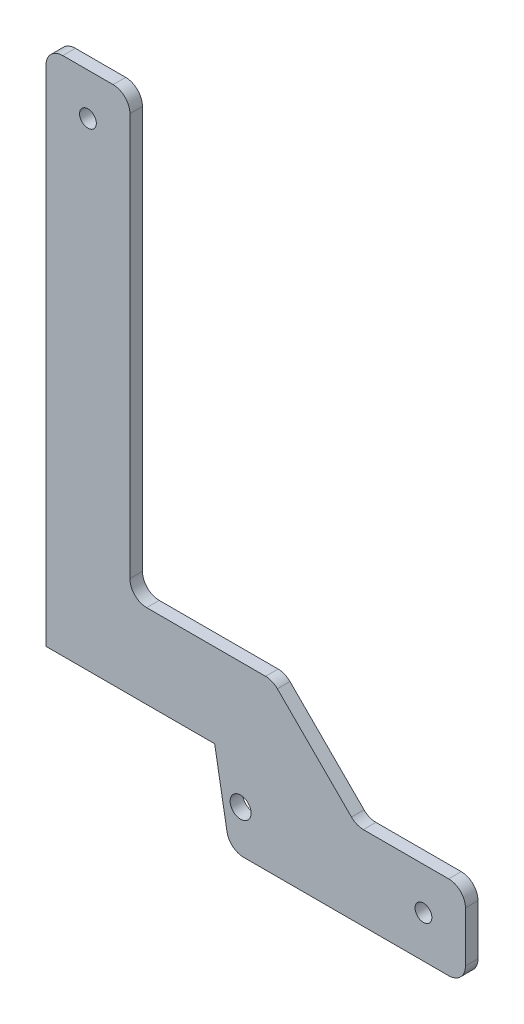
ISO-10303-21;
HEADER;
FILE_DESCRIPTION(('STEP AP214'),'2;1');
FILE_NAME('part.step','',(''),(''),'','','');
FILE_SCHEMA(('AUTOMOTIVE_DESIGN { 1 0 10303 214 1 1 1 1 }'));
ENDSEC;
DATA;
#1=APPLICATION_CONTEXT('core data for automotive mechanical design processes');
#2=APPLICATION_PROTOCOL_DEFINITION('international standard','automotive_design',2000,#1);
#3=PRODUCT_CONTEXT('',#1,'mechanical');
#4=PRODUCT('Part','Part','',(#3));
#5=PRODUCT_RELATED_PRODUCT_CATEGORY('part','',(#4));
#6=PRODUCT_DEFINITION_FORMATION('','',#4);
#7=PRODUCT_DEFINITION_CONTEXT('part definition',#1,'design');
#8=PRODUCT_DEFINITION('design','',#6,#7);
#9=PRODUCT_DEFINITION_SHAPE('','',#8);
#10=(LENGTH_UNIT() NAMED_UNIT(*) SI_UNIT(.MILLI.,.METRE.));
#11=(NAMED_UNIT(*) PLANE_ANGLE_UNIT() SI_UNIT($,.RADIAN.));
#12=(NAMED_UNIT(*) SI_UNIT($,.STERADIAN.) SOLID_ANGLE_UNIT());
#13=UNCERTAINTY_MEASURE_WITH_UNIT(LENGTH_MEASURE(1.E-05),#10,'distance_accuracy_value','');
#14=(GEOMETRIC_REPRESENTATION_CONTEXT(3) GLOBAL_UNCERTAINTY_ASSIGNED_CONTEXT((#13)) GLOBAL_UNIT_ASSIGNED_CONTEXT((#10,
#11,#12)) REPRESENTATION_CONTEXT('',''));
#15=CARTESIAN_POINT('',(0.,0.,0.));
#16=DIRECTION('',(0.,0.,1.));
#17=DIRECTION('',(1.,0.,0.));
#18=AXIS2_PLACEMENT_3D('',#15,#16,#17);
#19=CARTESIAN_POINT('',(-500.,-2.45636844198316E-12,-1322.5));
#20=DIRECTION('',(0.,-1.,0.));
#21=DIRECTION('',(1.,0.,0.));
#22=AXIS2_PLACEMENT_3D('',#19,#20,#21);
#23=PLANE('',#22);
#24=DIRECTION('',(0.,0.,-0.999999999999997));
#25=VECTOR('',#24,1.);
#26=CARTESIAN_POINT('',(-121.715728752538,-2.24820162486594E-12,-1322.5));
#27=LINE('',#26,#25);
#28=CARTESIAN_POINT('',(-121.715728752539,-1.89413572208877E-12,-1307.5));
#29=VERTEX_POINT('',#28);
#30=CARTESIAN_POINT('',(-121.715728752538,-2.24820162486594E-12,-1322.5));
#31=VERTEX_POINT('',#30);
#32=EDGE_CURVE('E11',#29,#31,#27,.T.);
#33=ORIENTED_EDGE('',*,*,#32,.F.);
#34=DIRECTION('',(-0.999999999999999,0.,0.));
#35=VECTOR('',#34,1.);
#36=CARTESIAN_POINT('',(-500.,-1.9151347174784E-12,-1307.5));
#37=LINE('',#36,#35);
#38=CARTESIAN_POINT('',(-20.0000000000009,-1.99951166734991E-12,-1307.5));
#39=VERTEX_POINT('',#38);
#40=EDGE_CURVE('E136',#29,#39,#37,.F.);
#41=ORIENTED_EDGE('',*,*,#40,.T.);
#42=DIRECTION('',(0.,0.,-0.999999999999997));
#43=VECTOR('',#42,1.);
#44=CARTESIAN_POINT('',(-20.,-2.35922392732846E-12,-1322.5));
#45=LINE('',#44,#43);
#46=CARTESIAN_POINT('',(-20.,-2.35922392732846E-12,-1322.5));
#47=VERTEX_POINT('',#46);
#48=EDGE_CURVE('E47',#39,#47,#45,.T.);
#49=ORIENTED_EDGE('',*,*,#48,.T.);
#50=DIRECTION('',(1.,0.,0.));
#51=VECTOR('',#50,1.);
#52=CARTESIAN_POINT('',(-500.,-2.45636844198316E-12,-1322.5));
#53=LINE('',#52,#51);
#54=EDGE_CURVE('E240',#31,#47,#53,.T.);
#55=ORIENTED_EDGE('',*,*,#54,.F.);
#56=EDGE_LOOP('',(#33,#41,#49,#55));
#57=FACE_BOUND('',#56,.T.);
#58=ADVANCED_FACE('F37',(#57),#23,.F.);
#59=CARTESIAN_POINT('',(-20.,-20.0000000000024,-1322.5));
#60=DIRECTION('',(0.,0.,0.999999999999997));
#61=DIRECTION('',(0.,-1.,0.));
#62=AXIS2_PLACEMENT_3D('',#59,#60,#61);
#63=CYLINDRICAL_SURFACE('',#62,20.);
#64=ORIENTED_EDGE('',*,*,#48,.F.);
#65=CARTESIAN_POINT('',(-20.,-20.0000000000024,-1307.5));
#66=DIRECTION('',(0.,0.,-0.999999999999997));
#67=DIRECTION('',(0.,1.,0.));
#68=AXIS2_PLACEMENT_3D('',#65,#66,#67);
#69=CIRCLE('',#68,20.);
#70=CARTESIAN_POINT('',(-8.88178419700125E-13,-20.0000000000021,-1307.5));
#71=VERTEX_POINT('',#70);
#72=EDGE_CURVE('E188',#71,#39,#69,.F.);
#73=ORIENTED_EDGE('',*,*,#72,.F.);
#74=DIRECTION('',(0.,0.,-0.999999999999997));
#75=VECTOR('',#74,1.);
#76=CARTESIAN_POINT('',(0.,-20.0000000000024,-1322.5));
#77=LINE('',#76,#75);
#78=CARTESIAN_POINT('',(0.,-20.0000000000024,-1322.5));
#79=VERTEX_POINT('',#78);
#80=EDGE_CURVE('E233',#71,#79,#77,.T.);
#81=ORIENTED_EDGE('',*,*,#80,.T.);
#82=CARTESIAN_POINT('',(-20.,-20.0000000000024,-1322.5));
#83=DIRECTION('',(0.,0.,-0.999999999999997));
#84=DIRECTION('',(0.,1.,0.));
#85=AXIS2_PLACEMENT_3D('',#82,#83,#84);
#86=CIRCLE('',#85,20.);
#87=EDGE_CURVE('E251',#79,#47,#86,.F.);
#88=ORIENTED_EDGE('',*,*,#87,.T.);
#89=EDGE_LOOP('',(#64,#73,#81,#88));
#90=FACE_BOUND('',#89,.T.);
#91=ADVANCED_FACE('F254',(#90),#63,.T.);
#92=CARTESIAN_POINT('',(1.52655665885959E-13,-100.000000000002,-1322.5));
#93=DIRECTION('',(1.,0.,0.));
#94=DIRECTION('',(0.,1.,0.));
#95=AXIS2_PLACEMENT_3D('',#92,#93,#94);
#96=PLANE('',#95);
#97=ORIENTED_EDGE('',*,*,#80,.F.);
#98=DIRECTION('',(0.,1.,0.));
#99=VECTOR('',#98,1.);
#100=CARTESIAN_POINT('',(-7.7715611723761E-13,-100.000000000003,-1307.5));
#101=LINE('',#100,#99);
#102=CARTESIAN_POINT('',(-7.7715611723761E-13,-80.0000000000024,-1307.5));
#103=VERTEX_POINT('',#102);
#104=EDGE_CURVE('E185',#103,#71,#101,.T.);
#105=ORIENTED_EDGE('',*,*,#104,.F.);
#106=DIRECTION('',(0.,0.,-0.999999999999997));
#107=VECTOR('',#106,1.);
#108=CARTESIAN_POINT('',(1.2490009027033E-13,-80.0000000000025,-1322.5));
#109=LINE('',#108,#107);
#110=CARTESIAN_POINT('',(1.2490009027033E-13,-80.0000000000025,-1322.5));
#111=VERTEX_POINT('',#110);
#112=EDGE_CURVE('E230',#103,#111,#109,.T.);
#113=ORIENTED_EDGE('',*,*,#112,.T.);
#114=DIRECTION('',(0.,1.,0.));
#115=VECTOR('',#114,1.);
#116=CARTESIAN_POINT('',(1.52655665885959E-13,-100.000000000002,-1322.5));
#117=LINE('',#116,#115);
#118=EDGE_CURVE('E255',#111,#79,#117,.T.);
#119=ORIENTED_EDGE('',*,*,#118,.T.);
#120=EDGE_LOOP('',(#97,#105,#113,#119));
#121=FACE_BOUND('',#120,.T.);
#122=ADVANCED_FACE('F327',(#121),#96,.T.);
#123=CARTESIAN_POINT('',(-20.,-80.0000000000024,-1322.5));
#124=DIRECTION('',(0.,0.,0.999999999999997));
#125=DIRECTION('',(0.,-1.,0.));
#126=AXIS2_PLACEMENT_3D('',#123,#124,#125);
#127=CYLINDRICAL_SURFACE('',#126,20.);
#128=ORIENTED_EDGE('',*,*,#112,.F.);
#129=CARTESIAN_POINT('',(-20.,-80.0000000000024,-1307.5));
#130=DIRECTION('',(0.,0.,-0.999999999999997));
#131=DIRECTION('',(0.,1.,0.));
#132=AXIS2_PLACEMENT_3D('',#129,#130,#131);
#133=CIRCLE('',#132,20.);
#134=CARTESIAN_POINT('',(-20.0000000000008,-100.000000000003,-1307.5));
#135=VERTEX_POINT('',#134);
#136=EDGE_CURVE('E182',#135,#103,#133,.F.);
#137=ORIENTED_EDGE('',*,*,#136,.F.);
#138=DIRECTION('',(0.,0.,-0.999999999999997));
#139=VECTOR('',#138,1.);
#140=CARTESIAN_POINT('',(-19.9999999999999,-100.000000000003,-1322.5));
#141=LINE('',#140,#139);
#142=CARTESIAN_POINT('',(-19.9999999999999,-100.000000000003,-1322.5));
#143=VERTEX_POINT('',#142);
#144=EDGE_CURVE('E227',#135,#143,#141,.T.);
#145=ORIENTED_EDGE('',*,*,#144,.T.);
#146=CARTESIAN_POINT('',(-20.,-80.0000000000024,-1322.5));
#147=DIRECTION('',(0.,0.,-0.999999999999997));
#148=DIRECTION('',(0.,1.,0.));
#149=AXIS2_PLACEMENT_3D('',#146,#147,#148);
#150=CIRCLE('',#149,20.);
#151=EDGE_CURVE('E257',#143,#111,#150,.F.);
#152=ORIENTED_EDGE('',*,*,#151,.T.);
#153=EDGE_LOOP('',(#128,#137,#145,#152));
#154=FACE_BOUND('',#153,.T.);
#155=ADVANCED_FACE('F332',(#154),#127,.T.);
#156=CARTESIAN_POINT('',(-500.,-100.000000000003,-1322.5));
#157=DIRECTION('',(0.,-1.,0.));
#158=DIRECTION('',(1.,0.,0.));
#159=AXIS2_PLACEMENT_3D('',#156,#157,#158);
#160=PLANE('',#159);
#161=ORIENTED_EDGE('',*,*,#144,.F.);
#162=DIRECTION('',(-0.999999999999999,0.,0.));
#163=VECTOR('',#162,1.);
#164=CARTESIAN_POINT('',(-500.,-100.000000000003,-1307.5));
#165=LINE('',#164,#163);
#166=CARTESIAN_POINT('',(-264.507495681785,-100.000000000003,-1307.5));
#167=VERTEX_POINT('',#166);
#168=EDGE_CURVE('E179',#167,#135,#165,.F.);
#169=ORIENTED_EDGE('',*,*,#168,.F.);
#170=DIRECTION('',(0.,0.,-0.999999999999997));
#171=VECTOR('',#170,1.);
#172=CARTESIAN_POINT('',(-264.507495681784,-100.000000000003,-1322.5));
#173=LINE('',#172,#171);
#174=CARTESIAN_POINT('',(-264.507495681784,-100.000000000003,-1322.5));
#175=VERTEX_POINT('',#174);
#176=EDGE_CURVE('E224',#167,#175,#173,.T.);
#177=ORIENTED_EDGE('',*,*,#176,.T.);
#178=DIRECTION('',(1.,0.,0.));
#179=VECTOR('',#178,1.);
#180=CARTESIAN_POINT('',(-500.,-100.000000000003,-1322.5));
#181=LINE('',#180,#179);
#182=EDGE_CURVE('E263',#175,#143,#181,.T.);
#183=ORIENTED_EDGE('',*,*,#182,.T.);
#184=EDGE_LOOP('',(#161,#169,#177,#183));
#185=FACE_BOUND('',#184,.T.);
#186=ADVANCED_FACE('F336',(#185),#160,.T.);
#187=CARTESIAN_POINT('',(-264.507495681784,-80.0000000000025,-1322.5));
#188=DIRECTION('',(0.,0.,0.999999999999997));
#189=DIRECTION('',(0.,-1.,0.));
#190=AXIS2_PLACEMENT_3D('',#187,#188,#189);
#191=CYLINDRICAL_SURFACE('',#190,20.);
#192=ORIENTED_EDGE('',*,*,#176,.F.);
#193=CARTESIAN_POINT('',(-264.507495681784,-80.0000000000025,-1307.5));
#194=DIRECTION('',(0.,0.,-0.999999999999997));
#195=DIRECTION('',(0.,1.,0.));
#196=AXIS2_PLACEMENT_3D('',#193,#194,#195);
#197=CIRCLE('',#196,20.);
#198=CARTESIAN_POINT('',(-284.203650742029,-83.4729635533412,-1307.5));
#199=VERTEX_POINT('',#198);
#200=EDGE_CURVE('E176',#199,#167,#197,.F.);
#201=ORIENTED_EDGE('',*,*,#200,.F.);
#202=DIRECTION('',(0.,0.,-0.999999999999997));
#203=VECTOR('',#202,1.);
#204=CARTESIAN_POINT('',(-284.203650742028,-83.4729635533413,-1322.5));
#205=LINE('',#204,#203);
#206=CARTESIAN_POINT('',(-284.203650742028,-83.4729635533413,-1322.5));
#207=VERTEX_POINT('',#206);
#208=EDGE_CURVE('E221',#199,#207,#205,.T.);
#209=ORIENTED_EDGE('',*,*,#208,.T.);
#210=CARTESIAN_POINT('',(-264.507495681784,-80.0000000000025,-1322.5));
#211=DIRECTION('',(0.,0.,-0.999999999999997));
#212=DIRECTION('',(0.,1.,0.));
#213=AXIS2_PLACEMENT_3D('',#210,#211,#212);
#214=CIRCLE('',#213,20.);
#215=EDGE_CURVE('E266',#207,#175,#214,.F.);
#216=ORIENTED_EDGE('',*,*,#215,.T.);
#217=EDGE_LOOP('',(#192,#201,#209,#216));
#218=FACE_BOUND('',#217,.T.);
#219=ADVANCED_FACE('F340',(#218),#191,.T.);
#220=CARTESIAN_POINT('',(-281.28948830533,-100.000000000002,-1322.5));
#221=DIRECTION('',(0.984807753012207,0.173648177666934,0.));
#222=DIRECTION('',(-0.173648177666935,0.984807753012209,0.));
#223=AXIS2_PLACEMENT_3D('',#220,#221,#222);
#224=PLANE('',#223);
#225=ORIENTED_EDGE('',*,*,#208,.F.);
#226=DIRECTION('',(-0.173648177666935,0.984807753012209,0.));
#227=VECTOR('',#226,1.);
#228=CARTESIAN_POINT('',(-281.28948830533,-100.000000000002,-1307.5));
#229=LINE('',#228,#227);
#230=CARTESIAN_POINT('',(-298.922186376177,-2.29255071517588E-12,-1307.5));
#231=VERTEX_POINT('',#230);
#232=EDGE_CURVE('E173',#199,#231,#229,.T.);
#233=ORIENTED_EDGE('',*,*,#232,.T.);
#234=DIRECTION('',(0.,0.,-0.999999999999997));
#235=VECTOR('',#234,1.);
#236=CARTESIAN_POINT('',(-298.922186376177,-2.65065747129256E-12,-1322.5));
#237=LINE('',#236,#235);
#238=CARTESIAN_POINT('',(-298.922186376177,-2.65065747129256E-12,-1322.5));
#239=VERTEX_POINT('',#238);
#240=EDGE_CURVE('E218',#231,#239,#237,.T.);
#241=ORIENTED_EDGE('',*,*,#240,.T.);
#242=DIRECTION('',(-0.173648177666935,0.984807753012209,0.));
#243=VECTOR('',#242,1.);
#244=CARTESIAN_POINT('',(-281.28948830533,-100.000000000002,-1322.5));
#245=LINE('',#244,#243);
#246=EDGE_CURVE('E269',#207,#239,#245,.T.);
#247=ORIENTED_EDGE('',*,*,#246,.F.);
#248=EDGE_LOOP('',(#225,#233,#241,#247));
#249=FACE_BOUND('',#248,.T.);
#250=ADVANCED_FACE('F344',(#249),#224,.F.);
#251=CARTESIAN_POINT('',(-130.,-2.33146835171283E-12,-1322.5));
#252=DIRECTION('',(0.,1.,0.));
#253=DIRECTION('',(-1.,0.,0.));
#254=AXIS2_PLACEMENT_3D('',#251,#252,#253);
#255=PLANE('',#254);
#256=ORIENTED_EDGE('',*,*,#240,.F.);
#257=DIRECTION('',(-0.999999999999999,0.,0.));
#258=VECTOR('',#257,1.);
#259=CARTESIAN_POINT('',(-500.,-2.3037127760972E-12,-1307.5));
#260=LINE('',#259,#258);
#261=CARTESIAN_POINT('',(-500.,-2.09554595897998E-12,-1307.5));
#262=VERTEX_POINT('',#261);
#263=EDGE_CURVE('E170',#231,#262,#260,.T.);
#264=ORIENTED_EDGE('',*,*,#263,.T.);
#265=DIRECTION('',(0.,0.,-0.999999999999997));
#266=VECTOR('',#265,1.);
#267=CARTESIAN_POINT('',(-500.,-2.45636844198316E-12,-1322.5));
#268=LINE('',#267,#266);
#269=CARTESIAN_POINT('',(-500.,-2.45636844198316E-12,-1322.5));
#270=VERTEX_POINT('',#269);
#271=EDGE_CURVE('E215',#262,#270,#268,.T.);
#272=ORIENTED_EDGE('',*,*,#271,.T.);
#273=DIRECTION('',(-1.,0.,0.));
#274=VECTOR('',#273,1.);
#275=CARTESIAN_POINT('',(-130.,-2.33146835171283E-12,-1322.5));
#276=LINE('',#275,#274);
#277=EDGE_CURVE('E272',#239,#270,#276,.T.);
#278=ORIENTED_EDGE('',*,*,#277,.F.);
#279=EDGE_LOOP('',(#256,#264,#272,#278));
#280=FACE_BOUND('',#279,.T.);
#281=ADVANCED_FACE('F348',(#280),#255,.F.);
#282=CARTESIAN_POINT('',(-500.000000000001,619.999999999999,-1322.5));
#283=DIRECTION('',(-1.,0.,0.));
#284=DIRECTION('',(0.,-1.,0.));
#285=AXIS2_PLACEMENT_3D('',#282,#283,#284);
#286=PLANE('',#285);
#287=ORIENTED_EDGE('',*,*,#271,.F.);
#288=DIRECTION('',(0.,1.,0.));
#289=VECTOR('',#288,1.);
#290=CARTESIAN_POINT('',(-500.,-100.000000000003,-1307.5));
#291=LINE('',#290,#289);
#292=CARTESIAN_POINT('',(-500.,600.000000000001,-1307.5));
#293=VERTEX_POINT('',#292);
#294=EDGE_CURVE('E167',#293,#262,#291,.F.);
#295=ORIENTED_EDGE('',*,*,#294,.F.);
#296=DIRECTION('',(0.,0.,-0.999999999999997));
#297=VECTOR('',#296,1.);
#298=CARTESIAN_POINT('',(-500.,599.999999999999,-1322.5));
#299=LINE('',#298,#297);
#300=CARTESIAN_POINT('',(-500.,599.999999999999,-1322.5));
#301=VERTEX_POINT('',#300);
#302=EDGE_CURVE('E212',#293,#301,#299,.T.);
#303=ORIENTED_EDGE('',*,*,#302,.T.);
#304=DIRECTION('',(0.,-1.,0.));
#305=VECTOR('',#304,1.);
#306=CARTESIAN_POINT('',(-500.000000000001,619.999999999999,-1322.5));
#307=LINE('',#306,#305);
#308=EDGE_CURVE('E275',#301,#270,#307,.T.);
#309=ORIENTED_EDGE('',*,*,#308,.T.);
#310=EDGE_LOOP('',(#287,#295,#303,#309));
#311=FACE_BOUND('',#310,.T.);
#312=ADVANCED_FACE('F352',(#311),#286,.T.);
#313=CARTESIAN_POINT('',(-480.000000000001,599.999999999999,-1322.5));
#314=DIRECTION('',(0.,0.,0.999999999999997));
#315=DIRECTION('',(0.,-1.,0.));
#316=AXIS2_PLACEMENT_3D('',#313,#314,#315);
#317=CYLINDRICAL_SURFACE('',#316,20.);
#318=ORIENTED_EDGE('',*,*,#302,.F.);
#319=CARTESIAN_POINT('',(-480.000000000001,599.999999999999,-1307.5));
#320=DIRECTION('',(0.,0.,-0.999999999999997));
#321=DIRECTION('',(0.,1.,0.));
#322=AXIS2_PLACEMENT_3D('',#319,#320,#321);
#323=CIRCLE('',#322,20.);
#324=CARTESIAN_POINT('',(-480.,620.000000000002,-1307.5));
#325=VERTEX_POINT('',#324);
#326=EDGE_CURVE('E164',#325,#293,#323,.F.);
#327=ORIENTED_EDGE('',*,*,#326,.F.);
#328=DIRECTION('',(0.,0.,-0.999999999999997));
#329=VECTOR('',#328,1.);
#330=CARTESIAN_POINT('',(-480.,619.999999999999,-1322.5));
#331=LINE('',#330,#329);
#332=CARTESIAN_POINT('',(-480.,619.999999999999,-1322.5));
#333=VERTEX_POINT('',#332);
#334=EDGE_CURVE('E209',#325,#333,#331,.T.);
#335=ORIENTED_EDGE('',*,*,#334,.T.);
#336=CARTESIAN_POINT('',(-480.000000000001,599.999999999999,-1322.5));
#337=DIRECTION('',(0.,0.,-0.999999999999997));
#338=DIRECTION('',(0.,1.,0.));
#339=AXIS2_PLACEMENT_3D('',#336,#337,#338);
#340=CIRCLE('',#339,20.);
#341=EDGE_CURVE('E278',#333,#301,#340,.F.);
#342=ORIENTED_EDGE('',*,*,#341,.T.);
#343=EDGE_LOOP('',(#318,#327,#335,#342));
#344=FACE_BOUND('',#343,.T.);
#345=ADVANCED_FACE('F356',(#344),#317,.T.);
#346=CARTESIAN_POINT('',(-500.000000000001,619.999999999999,-1322.5));
#347=DIRECTION('',(0.,-1.,0.));
#348=DIRECTION('',(1.,0.,0.));
#349=AXIS2_PLACEMENT_3D('',#346,#347,#348);
#350=PLANE('',#349);
#351=ORIENTED_EDGE('',*,*,#334,.F.);
#352=DIRECTION('',(-0.999999999999999,0.,0.));
#353=VECTOR('',#352,1.);
#354=CARTESIAN_POINT('',(-500.,620.000000000002,-1307.5));
#355=LINE('',#354,#353);
#356=CARTESIAN_POINT('',(-420.000000000001,620.000000000002,-1307.5));
#357=VERTEX_POINT('',#356);
#358=EDGE_CURVE('E161',#325,#357,#355,.F.);
#359=ORIENTED_EDGE('',*,*,#358,.T.);
#360=DIRECTION('',(0.,0.,-0.999999999999997));
#361=VECTOR('',#360,1.);
#362=CARTESIAN_POINT('',(-420.,619.999999999999,-1322.5));
#363=LINE('',#362,#361);
#364=CARTESIAN_POINT('',(-420.,619.999999999999,-1322.5));
#365=VERTEX_POINT('',#364);
#366=EDGE_CURVE('E206',#357,#365,#363,.T.);
#367=ORIENTED_EDGE('',*,*,#366,.T.);
#368=DIRECTION('',(1.,0.,0.));
#369=VECTOR('',#368,1.);
#370=CARTESIAN_POINT('',(-500.000000000001,619.999999999999,-1322.5));
#371=LINE('',#370,#369);
#372=EDGE_CURVE('E281',#333,#365,#371,.T.);
#373=ORIENTED_EDGE('',*,*,#372,.F.);
#374=EDGE_LOOP('',(#351,#359,#367,#373));
#375=FACE_BOUND('',#374,.T.);
#376=ADVANCED_FACE('F360',(#375),#350,.F.);
#377=CARTESIAN_POINT('',(-420.000000000001,599.999999999999,-1322.5));
#378=DIRECTION('',(0.,0.,0.999999999999997));
#379=DIRECTION('',(0.,-1.,0.));
#380=AXIS2_PLACEMENT_3D('',#377,#378,#379);
#381=CYLINDRICAL_SURFACE('',#380,20.);
#382=ORIENTED_EDGE('',*,*,#366,.F.);
#383=CARTESIAN_POINT('',(-420.000000000001,599.999999999999,-1307.5));
#384=DIRECTION('',(0.,0.,-0.999999999999997));
#385=DIRECTION('',(0.,1.,0.));
#386=AXIS2_PLACEMENT_3D('',#383,#384,#385);
#387=CIRCLE('',#386,20.);
#388=CARTESIAN_POINT('',(-400.000000000001,600.000000000002,-1307.5));
#389=VERTEX_POINT('',#388);
#390=EDGE_CURVE('E158',#389,#357,#387,.F.);
#391=ORIENTED_EDGE('',*,*,#390,.F.);
#392=DIRECTION('',(0.,0.,-0.999999999999997));
#393=VECTOR('',#392,1.);
#394=CARTESIAN_POINT('',(-400.000000000001,599.999999999999,-1322.5));
#395=LINE('',#394,#393);
#396=CARTESIAN_POINT('',(-400.000000000001,599.999999999999,-1322.5));
#397=VERTEX_POINT('',#396);
#398=EDGE_CURVE('E203',#389,#397,#395,.T.);
#399=ORIENTED_EDGE('',*,*,#398,.T.);
#400=CARTESIAN_POINT('',(-420.000000000001,599.999999999999,-1322.5));
#401=DIRECTION('',(0.,0.,-0.999999999999997));
#402=DIRECTION('',(0.,1.,0.));
#403=AXIS2_PLACEMENT_3D('',#400,#401,#402);
#404=CIRCLE('',#403,20.);
#405=EDGE_CURVE('E284',#397,#365,#404,.F.);
#406=ORIENTED_EDGE('',*,*,#405,.T.);
#407=EDGE_LOOP('',(#382,#391,#399,#406));
#408=FACE_BOUND('',#407,.T.);
#409=ADVANCED_FACE('F364',(#408),#381,.T.);
#410=CARTESIAN_POINT('',(-400.000000000001,619.999999999999,-1322.5));
#411=DIRECTION('',(-1.,0.,0.));
#412=DIRECTION('',(0.,-1.,0.));
#413=AXIS2_PLACEMENT_3D('',#410,#411,#412);
#414=PLANE('',#413);
#415=ORIENTED_EDGE('',*,*,#398,.F.);
#416=DIRECTION('',(0.,1.,0.));
#417=VECTOR('',#416,1.);
#418=CARTESIAN_POINT('',(-400.000000000001,-100.000000000003,-1307.5));
#419=LINE('',#418,#417);
#420=CARTESIAN_POINT('',(-400.000000000001,119.999999999998,-1307.5));
#421=VERTEX_POINT('',#420);
#422=EDGE_CURVE('E155',#389,#421,#419,.F.);
#423=ORIENTED_EDGE('',*,*,#422,.T.);
#424=DIRECTION('',(0.,0.,-0.999999999999997));
#425=VECTOR('',#424,1.);
#426=CARTESIAN_POINT('',(-400.000000000001,119.999999999998,-1322.5));
#427=LINE('',#426,#425);
#428=CARTESIAN_POINT('',(-400.000000000001,119.999999999998,-1322.5));
#429=VERTEX_POINT('',#428);
#430=EDGE_CURVE('E200',#421,#429,#427,.T.);
#431=ORIENTED_EDGE('',*,*,#430,.T.);
#432=DIRECTION('',(0.,-1.,0.));
#433=VECTOR('',#432,1.);
#434=CARTESIAN_POINT('',(-400.000000000001,619.999999999999,-1322.5));
#435=LINE('',#434,#433);
#436=EDGE_CURVE('E287',#397,#429,#435,.T.);
#437=ORIENTED_EDGE('',*,*,#436,.F.);
#438=EDGE_LOOP('',(#415,#423,#431,#437));
#439=FACE_BOUND('',#438,.T.);
#440=ADVANCED_FACE('F368',(#439),#414,.F.);
#441=CARTESIAN_POINT('',(-380.000000000001,119.999999999998,-1322.5));
#442=DIRECTION('',(0.,0.,0.999999999999997));
#443=DIRECTION('',(0.,-1.,0.));
#444=AXIS2_PLACEMENT_3D('',#441,#442,#443);
#445=CYLINDRICAL_SURFACE('',#444,20.);
#446=ORIENTED_EDGE('',*,*,#430,.F.);
#447=CARTESIAN_POINT('',(-380.000000000001,119.999999999998,-1307.5));
#448=DIRECTION('',(0.,0.,-0.999999999999997));
#449=DIRECTION('',(0.,1.,0.));
#450=AXIS2_PLACEMENT_3D('',#447,#448,#449);
#451=CIRCLE('',#450,20.);
#452=CARTESIAN_POINT('',(-380.000000000001,99.9999999999984,-1307.5));
#453=VERTEX_POINT('',#452);
#454=EDGE_CURVE('E152',#453,#421,#451,.T.);
#455=ORIENTED_EDGE('',*,*,#454,.F.);
#456=DIRECTION('',(0.,0.,-0.999999999999997));
#457=VECTOR('',#456,1.);
#458=CARTESIAN_POINT('',(-380.000000000001,99.9999999999976,-1322.5));
#459=LINE('',#458,#457);
#460=CARTESIAN_POINT('',(-380.000000000001,99.9999999999976,-1322.5));
#461=VERTEX_POINT('',#460);
#462=EDGE_CURVE('E197',#453,#461,#459,.T.);
#463=ORIENTED_EDGE('',*,*,#462,.T.);
#464=CARTESIAN_POINT('',(-380.000000000001,119.999999999998,-1322.5));
#465=DIRECTION('',(0.,0.,-0.999999999999997));
#466=DIRECTION('',(0.,1.,0.));
#467=AXIS2_PLACEMENT_3D('',#464,#465,#466);
#468=CIRCLE('',#467,20.);
#469=EDGE_CURVE('E290',#461,#429,#468,.T.);
#470=ORIENTED_EDGE('',*,*,#469,.T.);
#471=EDGE_LOOP('',(#446,#455,#463,#470));
#472=FACE_BOUND('',#471,.T.);
#473=ADVANCED_FACE('F372',(#472),#445,.F.);
#474=CARTESIAN_POINT('',(-130.,99.9999999999978,-1322.5));
#475=DIRECTION('',(0.,1.,0.));
#476=DIRECTION('',(-1.,0.,0.));
#477=AXIS2_PLACEMENT_3D('',#474,#475,#476);
#478=PLANE('',#477);
#479=ORIENTED_EDGE('',*,*,#462,.F.);
#480=DIRECTION('',(-0.999999999999999,0.,0.));
#481=VECTOR('',#480,1.);
#482=CARTESIAN_POINT('',(-500.,99.9999999999986,-1307.5));
#483=LINE('',#482,#481);
#484=CARTESIAN_POINT('',(-238.284271247463,99.9999999999986,-1307.5));
#485=VERTEX_POINT('',#484);
#486=EDGE_CURVE('E149',#485,#453,#483,.T.);
#487=ORIENTED_EDGE('',*,*,#486,.F.);
#488=DIRECTION('',(0.,0.,-0.999999999999997));
#489=VECTOR('',#488,1.);
#490=CARTESIAN_POINT('',(-238.284271247463,99.9999999999979,-1322.5));
#491=LINE('',#490,#489);
#492=CARTESIAN_POINT('',(-238.284271247463,99.9999999999979,-1322.5));
#493=VERTEX_POINT('',#492);
#494=EDGE_CURVE('E195',#485,#493,#491,.T.);
#495=ORIENTED_EDGE('',*,*,#494,.T.);
#496=DIRECTION('',(-1.,0.,0.));
#497=VECTOR('',#496,1.);
#498=CARTESIAN_POINT('',(-130.,99.9999999999978,-1322.5));
#499=LINE('',#498,#497);
#500=EDGE_CURVE('E293',#493,#461,#499,.T.);
#501=ORIENTED_EDGE('',*,*,#500,.T.);
#502=EDGE_LOOP('',(#479,#487,#495,#501));
#503=FACE_BOUND('',#502,.T.);
#504=ADVANCED_FACE('F376',(#503),#478,.T.);
#505=CARTESIAN_POINT('',(-238.284271247462,79.9999999999979,-1322.5));
#506=DIRECTION('',(0.,0.,0.999999999999997));
#507=DIRECTION('',(0.,-1.,0.));
#508=AXIS2_PLACEMENT_3D('',#505,#506,#507);
#509=CYLINDRICAL_SURFACE('',#508,20.);
#510=ORIENTED_EDGE('',*,*,#494,.F.);
#511=CARTESIAN_POINT('',(-238.284271247462,79.9999999999979,-1307.5));
#512=DIRECTION('',(0.,0.,-0.999999999999997));
#513=DIRECTION('',(0.,1.,0.));
#514=AXIS2_PLACEMENT_3D('',#511,#512,#513);
#515=CIRCLE('',#514,20.);
#516=CARTESIAN_POINT('',(-224.142135623732,94.1421356237295,-1307.5));
#517=VERTEX_POINT('',#516);
#518=EDGE_CURVE('E146',#517,#485,#515,.F.);
#519=ORIENTED_EDGE('',*,*,#518,.F.);
#520=DIRECTION('',(0.,0.,-0.999999999999997));
#521=VECTOR('',#520,1.);
#522=CARTESIAN_POINT('',(-224.142135623732,94.1421356237289,-1322.5));
#523=LINE('',#522,#521);
#524=CARTESIAN_POINT('',(-224.142135623732,94.1421356237289,-1322.5));
#525=VERTEX_POINT('',#524);
#526=EDGE_CURVE('E55',#517,#525,#523,.T.);
#527=ORIENTED_EDGE('',*,*,#526,.T.);
#528=CARTESIAN_POINT('',(-238.284271247462,79.9999999999979,-1322.5));
#529=DIRECTION('',(0.,0.,-0.999999999999997));
#530=DIRECTION('',(0.,1.,0.));
#531=AXIS2_PLACEMENT_3D('',#528,#529,#530);
#532=CIRCLE('',#531,20.);
#533=EDGE_CURVE('E296',#525,#493,#532,.F.);
#534=ORIENTED_EDGE('',*,*,#533,.T.);
#535=EDGE_LOOP('',(#510,#519,#527,#534));
#536=FACE_BOUND('',#535,.T.);
#537=ADVANCED_FACE('F380',(#536),#509,.T.);
#538=CARTESIAN_POINT('',(-130.,-2.1094237467878E-12,-1322.5));
#539=DIRECTION('',(-0.707106781186546,-0.707106781186549,0.));
#540=DIRECTION('',(0.70710678118655,-0.707106781186548,0.));
#541=AXIS2_PLACEMENT_3D('',#538,#539,#540);
#542=PLANE('',#541);
#543=ORIENTED_EDGE('',*,*,#526,.F.);
#544=DIRECTION('',(0.70710678118655,-0.707106781186548,0.));
#545=VECTOR('',#544,1.);
#546=CARTESIAN_POINT('',(-130.,-2.10718099715102E-12,-1307.5));
#547=LINE('',#546,#545);
#548=CARTESIAN_POINT('',(-135.85786437627,5.85786437626713,-1307.5));
#549=VERTEX_POINT('',#548);
#550=EDGE_CURVE('E134',#549,#517,#547,.F.);
#551=ORIENTED_EDGE('',*,*,#550,.F.);
#552=DIRECTION('',(0.,0.,-0.999999999999997));
#553=VECTOR('',#552,1.);
#554=CARTESIAN_POINT('',(-135.857864376269,5.85786437626673,-1322.5));
#555=LINE('',#554,#553);
#556=CARTESIAN_POINT('',(-135.857864376269,5.85786437626673,-1322.5));
#557=VERTEX_POINT('',#556);
#558=EDGE_CURVE('E41',#549,#557,#555,.T.);
#559=ORIENTED_EDGE('',*,*,#558,.T.);
#560=DIRECTION('',(0.70710678118655,-0.707106781186548,0.));
#561=VECTOR('',#560,1.);
#562=CARTESIAN_POINT('',(-130.,-2.1094237467878E-12,-1322.5));
#563=LINE('',#562,#561);
#564=EDGE_CURVE('E636',#557,#525,#563,.F.);
#565=ORIENTED_EDGE('',*,*,#564,.T.);
#566=EDGE_LOOP('',(#543,#551,#559,#565));
#567=FACE_BOUND('',#566,.T.);
#568=ADVANCED_FACE('F138',(#567),#542,.F.);
#569=CARTESIAN_POINT('',(-49.9999999999999,-50.0000000000024,-1322.5));
#570=DIRECTION('',(0.,0.,0.999999999999997));
#571=DIRECTION('',(0.,-1.,0.));
#572=AXIS2_PLACEMENT_3D('',#569,#570,#571);
#573=CYLINDRICAL_SURFACE('',#572,10.);
#574=CARTESIAN_POINT('',(-49.9999999999999,-50.0000000000024,-1322.5));
#575=DIRECTION('',(0.,0.,0.999999999999997));
#576=DIRECTION('',(1.,0.,0.));
#577=AXIS2_PLACEMENT_3D('',#574,#575,#576);
#578=CIRCLE('',#577,10.);
#579=CARTESIAN_POINT('',(-39.9999999999999,-50.0000000000024,-1322.5));
#580=VERTEX_POINT('',#579);
#581=EDGE_CURVE('E193',#580,#580,#578,.T.);
#582=ORIENTED_EDGE('',*,*,#581,.F.);
#583=EDGE_LOOP('',(#582));
#584=FACE_BOUND('',#583,.T.);
#585=CARTESIAN_POINT('',(-49.9999999999999,-50.0000000000024,-1307.5));
#586=DIRECTION('',(0.,0.,0.999999999999997));
#587=DIRECTION('',(0.,-1.,0.));
#588=AXIS2_PLACEMENT_3D('',#585,#586,#587);
#589=CIRCLE('',#588,10.);
#590=CARTESIAN_POINT('',(-49.9999999999999,-60.0000000000024,-1307.5));
#591=VERTEX_POINT('',#590);
#592=EDGE_CURVE('E142',#591,#591,#589,.T.);
#593=ORIENTED_EDGE('',*,*,#592,.T.);
#594=EDGE_LOOP('',(#593));
#595=FACE_BOUND('',#594,.T.);
#596=ADVANCED_FACE('F302',(#584,#595),#573,.F.);
#597=CARTESIAN_POINT('',(-268.000000000001,-50.0000000000026,-1322.5));
#598=DIRECTION('',(0.,0.,0.999999999999997));
#599=DIRECTION('',(0.,-1.,0.));
#600=AXIS2_PLACEMENT_3D('',#597,#598,#599);
#601=CYLINDRICAL_SURFACE('',#600,12.5);
#602=CARTESIAN_POINT('',(-268.000000000001,-50.0000000000026,-1322.5));
#603=DIRECTION('',(0.,0.,0.999999999999997));
#604=DIRECTION('',(1.,0.,0.));
#605=AXIS2_PLACEMENT_3D('',#602,#603,#604);
#606=CIRCLE('',#605,12.5);
#607=CARTESIAN_POINT('',(-255.500000000001,-50.0000000000026,-1322.5));
#608=VERTEX_POINT('',#607);
#609=EDGE_CURVE('E635',#608,#608,#606,.T.);
#610=ORIENTED_EDGE('',*,*,#609,.F.);
#611=EDGE_LOOP('',(#610));
#612=FACE_BOUND('',#611,.T.);
#613=CARTESIAN_POINT('',(-268.000000000001,-50.0000000000026,-1307.5));
#614=DIRECTION('',(0.,0.,0.999999999999997));
#615=DIRECTION('',(0.,-1.,0.));
#616=AXIS2_PLACEMENT_3D('',#613,#614,#615);
#617=CIRCLE('',#616,12.5);
#618=CARTESIAN_POINT('',(-268.000000000001,-62.5000000000026,-1307.5));
#619=VERTEX_POINT('',#618);
#620=EDGE_CURVE('E139',#619,#619,#617,.T.);
#621=ORIENTED_EDGE('',*,*,#620,.T.);
#622=EDGE_LOOP('',(#621));
#623=FACE_BOUND('',#622,.T.);
#624=ADVANCED_FACE('F309',(#612,#623),#601,.F.);
#625=CARTESIAN_POINT('',(-121.715728752538,19.9999999999976,-1322.5));
#626=DIRECTION('',(0.,0.,0.999999999999997));
#627=DIRECTION('',(0.,-1.,0.));
#628=AXIS2_PLACEMENT_3D('',#625,#626,#627);
#629=CYLINDRICAL_SURFACE('',#628,20.);
#630=CARTESIAN_POINT('',(-121.715728752538,19.9999999999976,-1307.5));
#631=DIRECTION('',(0.,0.,-0.999999999999997));
#632=DIRECTION('',(0.,1.,0.));
#633=AXIS2_PLACEMENT_3D('',#630,#631,#632);
#634=CIRCLE('',#633,20.);
#635=EDGE_CURVE('E122',#29,#549,#634,.T.);
#636=ORIENTED_EDGE('',*,*,#635,.F.);
#637=ORIENTED_EDGE('',*,*,#32,.T.);
#638=CARTESIAN_POINT('',(-121.715728752538,19.9999999999976,-1322.5));
#639=DIRECTION('',(0.,0.,-0.999999999999997));
#640=DIRECTION('',(0.,1.,0.));
#641=AXIS2_PLACEMENT_3D('',#638,#639,#640);
#642=CIRCLE('',#641,20.);
#643=EDGE_CURVE('E124',#31,#557,#642,.T.);
#644=ORIENTED_EDGE('',*,*,#643,.T.);
#645=ORIENTED_EDGE('',*,*,#558,.F.);
#646=EDGE_LOOP('',(#636,#637,#644,#645));
#647=FACE_BOUND('',#646,.T.);
#648=ADVANCED_FACE('F121',(#647),#629,.F.);
#649=CARTESIAN_POINT('',(-450.000000000001,569.999999999999,-1322.5));
#650=DIRECTION('',(0.,0.,0.999999999999997));
#651=DIRECTION('',(0.,-1.,0.));
#652=AXIS2_PLACEMENT_3D('',#649,#650,#651);
#653=CYLINDRICAL_SURFACE('',#652,10.);
#654=CARTESIAN_POINT('',(-450.000000000001,569.999999999999,-1322.5));
#655=DIRECTION('',(0.,0.,0.999999999999997));
#656=DIRECTION('',(1.,0.,0.));
#657=AXIS2_PLACEMENT_3D('',#654,#655,#656);
#658=CIRCLE('',#657,10.);
#659=CARTESIAN_POINT('',(-440.000000000001,569.999999999999,-1322.5));
#660=VERTEX_POINT('',#659);
#661=EDGE_CURVE('E128',#660,#660,#658,.T.);
#662=ORIENTED_EDGE('',*,*,#661,.F.);
#663=EDGE_LOOP('',(#662));
#664=FACE_BOUND('',#663,.T.);
#665=CARTESIAN_POINT('',(-450.000000000001,569.999999999999,-1307.5));
#666=DIRECTION('',(0.,0.,0.999999999999997));
#667=DIRECTION('',(0.,-1.,0.));
#668=AXIS2_PLACEMENT_3D('',#665,#666,#667);
#669=CIRCLE('',#668,10.);
#670=CARTESIAN_POINT('',(-450.000000000001,559.999999999999,-1307.5));
#671=VERTEX_POINT('',#670);
#672=EDGE_CURVE('E148',#671,#671,#669,.T.);
#673=ORIENTED_EDGE('',*,*,#672,.T.);
#674=EDGE_LOOP('',(#673));
#675=FACE_BOUND('',#674,.T.);
#676=ADVANCED_FACE('F39',(#664,#675),#653,.F.);
#677=CARTESIAN_POINT('',(-500.,-100.000000000003,-1322.5));
#678=DIRECTION('',(0.,0.,0.999999999999997));
#679=DIRECTION('',(0.,1.,0.));
#680=AXIS2_PLACEMENT_3D('',#677,#678,#679);
#681=PLANE('',#680);
#682=ORIENTED_EDGE('',*,*,#581,.T.);
#683=EDGE_LOOP('',(#682));
#684=FACE_BOUND('',#683,.T.);
#685=ORIENTED_EDGE('',*,*,#609,.T.);
#686=EDGE_LOOP('',(#685));
#687=FACE_BOUND('',#686,.T.);
#688=ORIENTED_EDGE('',*,*,#564,.F.);
#689=ORIENTED_EDGE('',*,*,#643,.F.);
#690=ORIENTED_EDGE('',*,*,#54,.T.);
#691=ORIENTED_EDGE('',*,*,#87,.F.);
#692=ORIENTED_EDGE('',*,*,#118,.F.);
#693=ORIENTED_EDGE('',*,*,#151,.F.);
#694=ORIENTED_EDGE('',*,*,#182,.F.);
#695=ORIENTED_EDGE('',*,*,#215,.F.);
#696=ORIENTED_EDGE('',*,*,#246,.T.);
#697=ORIENTED_EDGE('',*,*,#277,.T.);
#698=ORIENTED_EDGE('',*,*,#308,.F.);
#699=ORIENTED_EDGE('',*,*,#341,.F.);
#700=ORIENTED_EDGE('',*,*,#372,.T.);
#701=ORIENTED_EDGE('',*,*,#405,.F.);
#702=ORIENTED_EDGE('',*,*,#436,.T.);
#703=ORIENTED_EDGE('',*,*,#469,.F.);
#704=ORIENTED_EDGE('',*,*,#500,.F.);
#705=ORIENTED_EDGE('',*,*,#533,.F.);
#706=EDGE_LOOP('',(#688,#689,#690,#691,#692,#693,#694,#695,#696,#697,#698,#699,#700,#701,#702,
#703,#704,#705));
#707=FACE_BOUND('',#706,.T.);
#708=ORIENTED_EDGE('',*,*,#661,.T.);
#709=EDGE_LOOP('',(#708));
#710=FACE_BOUND('',#709,.T.);
#711=ADVANCED_FACE('F248',(#684,#687,#707,#710),#681,.F.);
#712=CARTESIAN_POINT('',(-500.,-100.000000000003,-1307.5));
#713=DIRECTION('',(0.,0.,0.999999999999997));
#714=DIRECTION('',(0.,1.,0.));
#715=AXIS2_PLACEMENT_3D('',#712,#713,#714);
#716=PLANE('',#715);
#717=ORIENTED_EDGE('',*,*,#592,.F.);
#718=EDGE_LOOP('',(#717));
#719=FACE_BOUND('',#718,.T.);
#720=ORIENTED_EDGE('',*,*,#620,.F.);
#721=EDGE_LOOP('',(#720));
#722=FACE_BOUND('',#721,.T.);
#723=ORIENTED_EDGE('',*,*,#550,.T.);
#724=ORIENTED_EDGE('',*,*,#518,.T.);
#725=ORIENTED_EDGE('',*,*,#486,.T.);
#726=ORIENTED_EDGE('',*,*,#454,.T.);
#727=ORIENTED_EDGE('',*,*,#422,.F.);
#728=ORIENTED_EDGE('',*,*,#390,.T.);
#729=ORIENTED_EDGE('',*,*,#358,.F.);
#730=ORIENTED_EDGE('',*,*,#326,.T.);
#731=ORIENTED_EDGE('',*,*,#294,.T.);
#732=ORIENTED_EDGE('',*,*,#263,.F.);
#733=ORIENTED_EDGE('',*,*,#232,.F.);
#734=ORIENTED_EDGE('',*,*,#200,.T.);
#735=ORIENTED_EDGE('',*,*,#168,.T.);
#736=ORIENTED_EDGE('',*,*,#136,.T.);
#737=ORIENTED_EDGE('',*,*,#104,.T.);
#738=ORIENTED_EDGE('',*,*,#72,.T.);
#739=ORIENTED_EDGE('',*,*,#40,.F.);
#740=ORIENTED_EDGE('',*,*,#635,.T.);
#741=EDGE_LOOP('',(#723,#724,#725,#726,#727,#728,#729,#730,#731,#732,#733,#734,#735,#736,#737,
#738,#739,#740));
#742=FACE_BOUND('',#741,.T.);
#743=ORIENTED_EDGE('',*,*,#672,.F.);
#744=EDGE_LOOP('',(#743));
#745=FACE_BOUND('',#744,.T.);
#746=ADVANCED_FACE('F131',(#719,#722,#742,#745),#716,.T.);
#747=CLOSED_SHELL('',(#58,#91,#122,#155,#186,#219,#250,#281,#312,#345,#376,#409,#440,#473,#504,
#537,#568,#596,#624,#648,#676,#711,#746));
#748=MANIFOLD_SOLID_BREP('B2',#747);
#749=ADVANCED_BREP_SHAPE_REPRESENTATION('',(#18,#748),#14);
#750=SHAPE_DEFINITION_REPRESENTATION(#9,#749);
ENDSEC;
END-ISO-10303-21;
